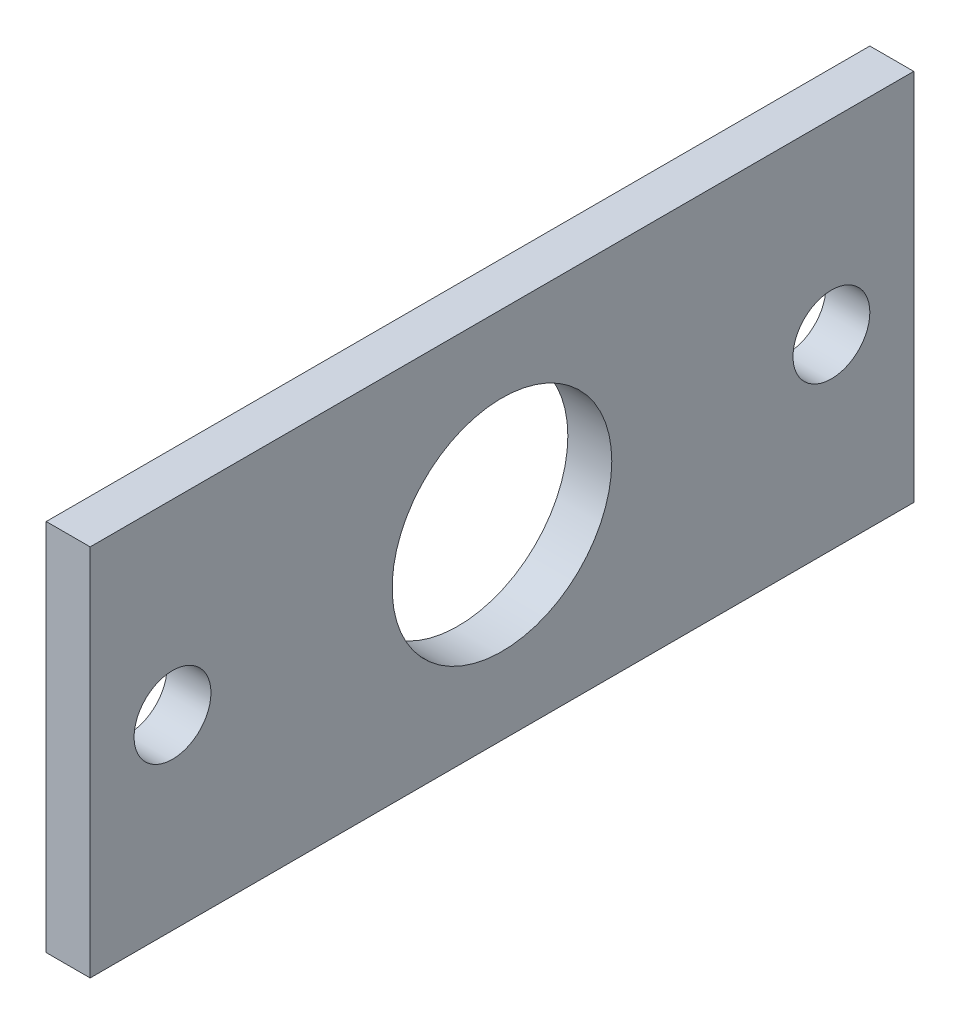
ISO-10303-21;
HEADER;
FILE_DESCRIPTION(('STEP AP214'),'2;1');
FILE_NAME('part.step','',(''),(''),'','','');
FILE_SCHEMA(('AUTOMOTIVE_DESIGN { 1 0 10303 214 1 1 1 1 }'));
ENDSEC;
DATA;
#1=APPLICATION_CONTEXT('core data for automotive mechanical design processes');
#2=APPLICATION_PROTOCOL_DEFINITION('international standard','automotive_design',2000,#1);
#3=PRODUCT_CONTEXT('',#1,'mechanical');
#4=PRODUCT('Part','Part','',(#3));
#5=PRODUCT_RELATED_PRODUCT_CATEGORY('part','',(#4));
#6=PRODUCT_DEFINITION_FORMATION('','',#4);
#7=PRODUCT_DEFINITION_CONTEXT('part definition',#1,'design');
#8=PRODUCT_DEFINITION('design','',#6,#7);
#9=PRODUCT_DEFINITION_SHAPE('','',#8);
#10=(LENGTH_UNIT() NAMED_UNIT(*) SI_UNIT(.MILLI.,.METRE.));
#11=(NAMED_UNIT(*) PLANE_ANGLE_UNIT() SI_UNIT($,.RADIAN.));
#12=(NAMED_UNIT(*) SI_UNIT($,.STERADIAN.) SOLID_ANGLE_UNIT());
#13=UNCERTAINTY_MEASURE_WITH_UNIT(LENGTH_MEASURE(1.E-05),#10,'distance_accuracy_value','');
#14=(GEOMETRIC_REPRESENTATION_CONTEXT(3) GLOBAL_UNCERTAINTY_ASSIGNED_CONTEXT((#13)) GLOBAL_UNIT_ASSIGNED_CONTEXT((#10,
#11,#12)) REPRESENTATION_CONTEXT('',''));
#15=CARTESIAN_POINT('',(0.,0.,0.));
#16=DIRECTION('',(0.,0.,1.));
#17=DIRECTION('',(1.,0.,0.));
#18=AXIS2_PLACEMENT_3D('',#15,#16,#17);
#19=CARTESIAN_POINT('',(0.,0.,0.));
#20=DIRECTION('',(1.,0.,0.));
#21=DIRECTION('',(0.,1.,0.));
#22=AXIS2_PLACEMENT_3D('',#19,#20,#21);
#23=PLANE('',#22);
#24=DIRECTION('',(0.,0.,1.));
#25=VECTOR('',#24,1.);
#26=CARTESIAN_POINT('',(0.,17.,-37.5));
#27=LINE('',#26,#25);
#28=CARTESIAN_POINT('',(0.,17.,-37.5));
#29=VERTEX_POINT('',#28);
#30=CARTESIAN_POINT('',(0.,17.,37.5));
#31=VERTEX_POINT('',#30);
#32=EDGE_CURVE('E111',#29,#31,#27,.T.);
#33=ORIENTED_EDGE('',*,*,#32,.T.);
#34=DIRECTION('',(0.,-1.,0.));
#35=VECTOR('',#34,1.);
#36=CARTESIAN_POINT('',(0.,17.,37.5));
#37=LINE('',#36,#35);
#38=CARTESIAN_POINT('',(0.,-17.,37.5));
#39=VERTEX_POINT('',#38);
#40=EDGE_CURVE('E144',#31,#39,#37,.T.);
#41=ORIENTED_EDGE('',*,*,#40,.T.);
#42=DIRECTION('',(0.,0.,-1.));
#43=VECTOR('',#42,1.);
#44=CARTESIAN_POINT('',(0.,-17.,37.5));
#45=LINE('',#44,#43);
#46=CARTESIAN_POINT('',(0.,-17.,-37.5));
#47=VERTEX_POINT('',#46);
#48=EDGE_CURVE('E112',#39,#47,#45,.T.);
#49=ORIENTED_EDGE('',*,*,#48,.T.);
#50=DIRECTION('',(0.,1.,0.));
#51=VECTOR('',#50,1.);
#52=CARTESIAN_POINT('',(0.,-17.,-37.5));
#53=LINE('',#52,#51);
#54=EDGE_CURVE('E27',#47,#29,#53,.T.);
#55=ORIENTED_EDGE('',*,*,#54,.T.);
#56=EDGE_LOOP('',(#33,#41,#49,#55));
#57=FACE_BOUND('',#56,.T.);
#58=CARTESIAN_POINT('',(0.,0.,-30.));
#59=DIRECTION('',(1.,0.,0.));
#60=DIRECTION('',(0.,0.,-1.));
#61=AXIS2_PLACEMENT_3D('',#58,#59,#60);
#62=CIRCLE('',#61,3.5);
#63=CARTESIAN_POINT('',(0.,0.,-33.5));
#64=VERTEX_POINT('',#63);
#65=EDGE_CURVE('E76',#64,#64,#62,.T.);
#66=ORIENTED_EDGE('',*,*,#65,.F.);
#67=EDGE_LOOP('',(#66));
#68=FACE_BOUND('',#67,.T.);
#69=CARTESIAN_POINT('',(0.,0.,0.));
#70=DIRECTION('',(1.,0.,0.));
#71=DIRECTION('',(0.,0.,-1.));
#72=AXIS2_PLACEMENT_3D('',#69,#70,#71);
#73=CIRCLE('',#72,10.);
#74=CARTESIAN_POINT('',(0.,0.,-10.));
#75=VERTEX_POINT('',#74);
#76=EDGE_CURVE('E161',#75,#75,#73,.T.);
#77=ORIENTED_EDGE('',*,*,#76,.F.);
#78=EDGE_LOOP('',(#77));
#79=FACE_BOUND('',#78,.T.);
#80=CARTESIAN_POINT('',(0.,0.,30.));
#81=DIRECTION('',(1.,0.,0.));
#82=DIRECTION('',(0.,0.,-1.));
#83=AXIS2_PLACEMENT_3D('',#80,#81,#82);
#84=CIRCLE('',#83,3.5);
#85=CARTESIAN_POINT('',(0.,0.,26.5));
#86=VERTEX_POINT('',#85);
#87=EDGE_CURVE('E39',#86,#86,#84,.T.);
#88=ORIENTED_EDGE('',*,*,#87,.F.);
#89=EDGE_LOOP('',(#88));
#90=FACE_BOUND('',#89,.T.);
#91=ADVANCED_FACE('F16',(#57,#68,#79,#90),#23,.T.);
#92=CARTESIAN_POINT('',(-4.,0.,0.));
#93=DIRECTION('',(1.,0.,0.));
#94=DIRECTION('',(0.,1.,0.));
#95=AXIS2_PLACEMENT_3D('',#92,#93,#94);
#96=PLANE('',#95);
#97=DIRECTION('',(0.,0.,1.));
#98=VECTOR('',#97,1.);
#99=CARTESIAN_POINT('',(-4.,17.,-37.5));
#100=LINE('',#99,#98);
#101=CARTESIAN_POINT('',(-4.,17.,-37.5));
#102=VERTEX_POINT('',#101);
#103=CARTESIAN_POINT('',(-4.,17.,37.5));
#104=VERTEX_POINT('',#103);
#105=EDGE_CURVE('E123',#102,#104,#100,.T.);
#106=ORIENTED_EDGE('',*,*,#105,.F.);
#107=DIRECTION('',(0.,1.,0.));
#108=VECTOR('',#107,1.);
#109=CARTESIAN_POINT('',(-4.,-17.,-37.5));
#110=LINE('',#109,#108);
#111=CARTESIAN_POINT('',(-4.,-17.,-37.5));
#112=VERTEX_POINT('',#111);
#113=EDGE_CURVE('E11',#112,#102,#110,.T.);
#114=ORIENTED_EDGE('',*,*,#113,.F.);
#115=DIRECTION('',(0.,0.,-1.));
#116=VECTOR('',#115,1.);
#117=CARTESIAN_POINT('',(-4.,-17.,37.5));
#118=LINE('',#117,#116);
#119=CARTESIAN_POINT('',(-4.,-17.,37.5));
#120=VERTEX_POINT('',#119);
#121=EDGE_CURVE('E20',#120,#112,#118,.T.);
#122=ORIENTED_EDGE('',*,*,#121,.F.);
#123=DIRECTION('',(0.,-1.,0.));
#124=VECTOR('',#123,1.);
#125=CARTESIAN_POINT('',(-4.,17.,37.5));
#126=LINE('',#125,#124);
#127=EDGE_CURVE('E139',#104,#120,#126,.T.);
#128=ORIENTED_EDGE('',*,*,#127,.F.);
#129=EDGE_LOOP('',(#106,#114,#122,#128));
#130=FACE_BOUND('',#129,.T.);
#131=CARTESIAN_POINT('',(-4.,0.,-30.));
#132=DIRECTION('',(1.,0.,0.));
#133=DIRECTION('',(0.,0.,-1.));
#134=AXIS2_PLACEMENT_3D('',#131,#132,#133);
#135=CIRCLE('',#134,3.5);
#136=CARTESIAN_POINT('',(-4.,0.,-33.5));
#137=VERTEX_POINT('',#136);
#138=EDGE_CURVE('E84',#137,#137,#135,.T.);
#139=ORIENTED_EDGE('',*,*,#138,.T.);
#140=EDGE_LOOP('',(#139));
#141=FACE_BOUND('',#140,.T.);
#142=CARTESIAN_POINT('',(-4.,0.,0.));
#143=DIRECTION('',(1.,0.,0.));
#144=DIRECTION('',(0.,0.,-1.));
#145=AXIS2_PLACEMENT_3D('',#142,#143,#144);
#146=CIRCLE('',#145,10.);
#147=CARTESIAN_POINT('',(-4.,0.,-10.));
#148=VERTEX_POINT('',#147);
#149=EDGE_CURVE('E67',#148,#148,#146,.T.);
#150=ORIENTED_EDGE('',*,*,#149,.T.);
#151=EDGE_LOOP('',(#150));
#152=FACE_BOUND('',#151,.T.);
#153=CARTESIAN_POINT('',(-4.,0.,30.));
#154=DIRECTION('',(1.,0.,0.));
#155=DIRECTION('',(0.,0.,-1.));
#156=AXIS2_PLACEMENT_3D('',#153,#154,#155);
#157=CIRCLE('',#156,3.5);
#158=CARTESIAN_POINT('',(-4.,0.,26.5));
#159=VERTEX_POINT('',#158);
#160=EDGE_CURVE('E136',#159,#159,#157,.T.);
#161=ORIENTED_EDGE('',*,*,#160,.T.);
#162=EDGE_LOOP('',(#161));
#163=FACE_BOUND('',#162,.T.);
#164=ADVANCED_FACE('F175',(#130,#141,#152,#163),#96,.F.);
#165=CARTESIAN_POINT('',(-4.,-17.,-37.5));
#166=DIRECTION('',(0.,0.,-1.));
#167=DIRECTION('',(0.,-1.,0.));
#168=AXIS2_PLACEMENT_3D('',#165,#166,#167);
#169=PLANE('',#168);
#170=ORIENTED_EDGE('',*,*,#54,.F.);
#171=DIRECTION('',(1.,0.,0.));
#172=VECTOR('',#171,1.);
#173=CARTESIAN_POINT('',(-4.,-17.,-37.5));
#174=LINE('',#173,#172);
#175=EDGE_CURVE('E158',#112,#47,#174,.T.);
#176=ORIENTED_EDGE('',*,*,#175,.F.);
#177=ORIENTED_EDGE('',*,*,#113,.T.);
#178=DIRECTION('',(1.,0.,0.));
#179=VECTOR('',#178,1.);
#180=CARTESIAN_POINT('',(-4.,17.,-37.5));
#181=LINE('',#180,#179);
#182=EDGE_CURVE('E118',#102,#29,#181,.T.);
#183=ORIENTED_EDGE('',*,*,#182,.T.);
#184=EDGE_LOOP('',(#170,#176,#177,#183));
#185=FACE_BOUND('',#184,.T.);
#186=ADVANCED_FACE('F119',(#185),#169,.T.);
#187=CARTESIAN_POINT('',(-4.,0.,30.));
#188=DIRECTION('',(1.,0.,0.));
#189=DIRECTION('',(0.,0.,-1.));
#190=AXIS2_PLACEMENT_3D('',#187,#188,#189);
#191=CYLINDRICAL_SURFACE('',#190,3.5);
#192=ORIENTED_EDGE('',*,*,#87,.T.);
#193=EDGE_LOOP('',(#192));
#194=FACE_BOUND('',#193,.T.);
#195=ORIENTED_EDGE('',*,*,#160,.F.);
#196=EDGE_LOOP('',(#195));
#197=FACE_BOUND('',#196,.T.);
#198=ADVANCED_FACE('F199',(#194,#197),#191,.F.);
#199=CARTESIAN_POINT('',(-4.,0.,0.));
#200=DIRECTION('',(1.,0.,0.));
#201=DIRECTION('',(0.,0.,-1.));
#202=AXIS2_PLACEMENT_3D('',#199,#200,#201);
#203=CYLINDRICAL_SURFACE('',#202,10.);
#204=ORIENTED_EDGE('',*,*,#76,.T.);
#205=EDGE_LOOP('',(#204));
#206=FACE_BOUND('',#205,.T.);
#207=ORIENTED_EDGE('',*,*,#149,.F.);
#208=EDGE_LOOP('',(#207));
#209=FACE_BOUND('',#208,.T.);
#210=ADVANCED_FACE('F18',(#206,#209),#203,.F.);
#211=CARTESIAN_POINT('',(-4.,0.,-30.));
#212=DIRECTION('',(1.,0.,0.));
#213=DIRECTION('',(0.,0.,-1.));
#214=AXIS2_PLACEMENT_3D('',#211,#212,#213);
#215=CYLINDRICAL_SURFACE('',#214,3.5);
#216=ORIENTED_EDGE('',*,*,#65,.T.);
#217=EDGE_LOOP('',(#216));
#218=FACE_BOUND('',#217,.T.);
#219=ORIENTED_EDGE('',*,*,#138,.F.);
#220=EDGE_LOOP('',(#219));
#221=FACE_BOUND('',#220,.T.);
#222=ADVANCED_FACE('F186',(#218,#221),#215,.F.);
#223=CARTESIAN_POINT('',(-4.,-17.,37.5));
#224=DIRECTION('',(0.,-1.,0.));
#225=DIRECTION('',(0.,0.,-1.));
#226=AXIS2_PLACEMENT_3D('',#223,#224,#225);
#227=PLANE('',#226);
#228=ORIENTED_EDGE('',*,*,#48,.F.);
#229=DIRECTION('',(1.,0.,0.));
#230=VECTOR('',#229,1.);
#231=CARTESIAN_POINT('',(-4.,-17.,37.5));
#232=LINE('',#231,#230);
#233=EDGE_CURVE('E143',#120,#39,#232,.T.);
#234=ORIENTED_EDGE('',*,*,#233,.F.);
#235=ORIENTED_EDGE('',*,*,#121,.T.);
#236=ORIENTED_EDGE('',*,*,#175,.T.);
#237=EDGE_LOOP('',(#228,#234,#235,#236));
#238=FACE_BOUND('',#237,.T.);
#239=ADVANCED_FACE('F174',(#238),#227,.T.);
#240=CARTESIAN_POINT('',(-4.,17.,37.5));
#241=DIRECTION('',(0.,0.,1.));
#242=DIRECTION('',(1.,0.,0.));
#243=AXIS2_PLACEMENT_3D('',#240,#241,#242);
#244=PLANE('',#243);
#245=ORIENTED_EDGE('',*,*,#40,.F.);
#246=DIRECTION('',(1.,0.,0.));
#247=VECTOR('',#246,1.);
#248=CARTESIAN_POINT('',(-4.,17.,37.5));
#249=LINE('',#248,#247);
#250=EDGE_CURVE('E128',#104,#31,#249,.T.);
#251=ORIENTED_EDGE('',*,*,#250,.F.);
#252=ORIENTED_EDGE('',*,*,#127,.T.);
#253=ORIENTED_EDGE('',*,*,#233,.T.);
#254=EDGE_LOOP('',(#245,#251,#252,#253));
#255=FACE_BOUND('',#254,.T.);
#256=ADVANCED_FACE('F177',(#255),#244,.T.);
#257=CARTESIAN_POINT('',(-4.,17.,-37.5));
#258=DIRECTION('',(0.,1.,0.));
#259=DIRECTION('',(1.,0.,0.));
#260=AXIS2_PLACEMENT_3D('',#257,#258,#259);
#261=PLANE('',#260);
#262=ORIENTED_EDGE('',*,*,#32,.F.);
#263=ORIENTED_EDGE('',*,*,#182,.F.);
#264=ORIENTED_EDGE('',*,*,#105,.T.);
#265=ORIENTED_EDGE('',*,*,#250,.T.);
#266=EDGE_LOOP('',(#262,#263,#264,#265));
#267=FACE_BOUND('',#266,.T.);
#268=ADVANCED_FACE('F126',(#267),#261,.T.);
#269=CLOSED_SHELL('',(#91,#164,#186,#198,#210,#222,#239,#256,#268));
#270=MANIFOLD_SOLID_BREP('B1',#269);
#271=ADVANCED_BREP_SHAPE_REPRESENTATION('',(#18,#270),#14);
#272=SHAPE_DEFINITION_REPRESENTATION(#9,#271);
ENDSEC;
END-ISO-10303-21;
